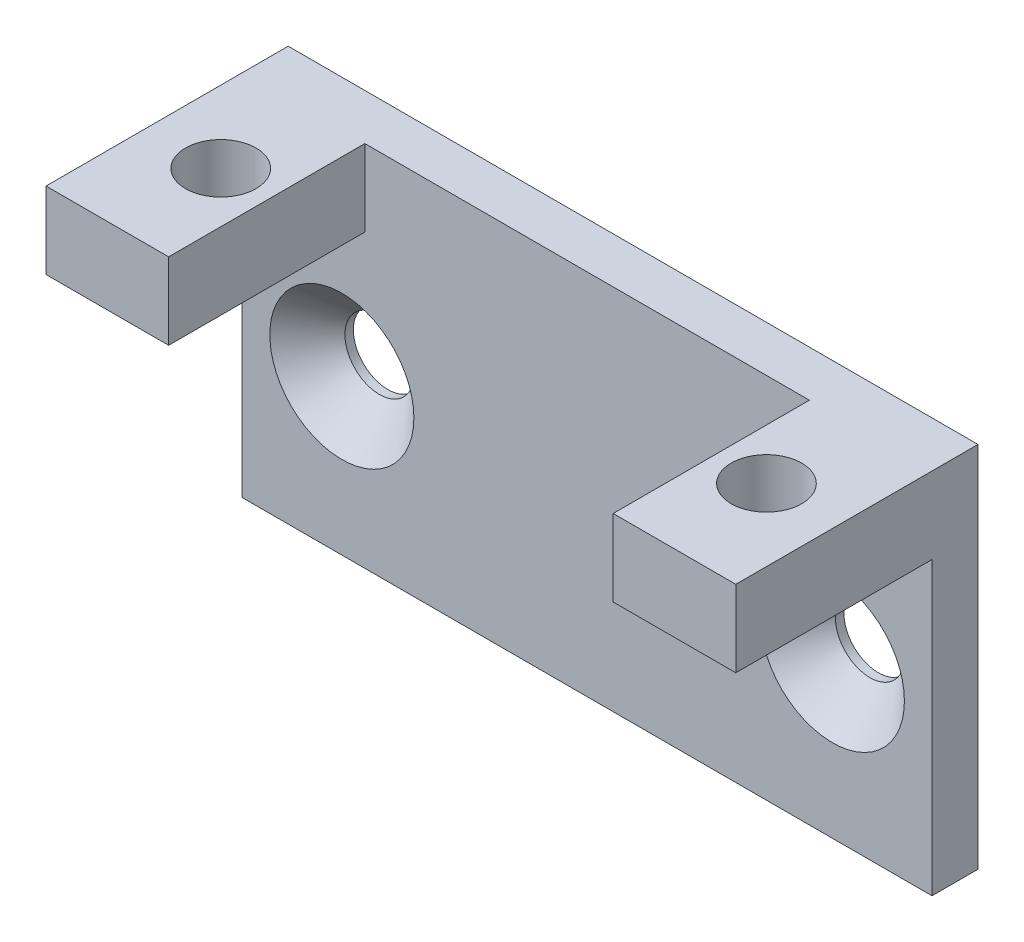
ISO-10303-21;
HEADER;
FILE_DESCRIPTION(('STEP AP214'),'2;1');
FILE_NAME('part.step','',(''),(''),'','','');
FILE_SCHEMA(('AUTOMOTIVE_DESIGN { 1 0 10303 214 1 1 1 1 }'));
ENDSEC;
DATA;
#1=APPLICATION_CONTEXT('core data for automotive mechanical design processes');
#2=APPLICATION_PROTOCOL_DEFINITION('international standard','automotive_design',2000,#1);
#3=PRODUCT_CONTEXT('',#1,'mechanical');
#4=PRODUCT('Part','Part','',(#3));
#5=PRODUCT_RELATED_PRODUCT_CATEGORY('part','',(#4));
#6=PRODUCT_DEFINITION_FORMATION('','',#4);
#7=PRODUCT_DEFINITION_CONTEXT('part definition',#1,'design');
#8=PRODUCT_DEFINITION('design','',#6,#7);
#9=PRODUCT_DEFINITION_SHAPE('','',#8);
#10=(LENGTH_UNIT() NAMED_UNIT(*) SI_UNIT(.MILLI.,.METRE.));
#11=(NAMED_UNIT(*) PLANE_ANGLE_UNIT() SI_UNIT($,.RADIAN.));
#12=(NAMED_UNIT(*) SI_UNIT($,.STERADIAN.) SOLID_ANGLE_UNIT());
#13=UNCERTAINTY_MEASURE_WITH_UNIT(LENGTH_MEASURE(1.E-05),#10,'distance_accuracy_value','');
#14=(GEOMETRIC_REPRESENTATION_CONTEXT(3) GLOBAL_UNCERTAINTY_ASSIGNED_CONTEXT((#13)) GLOBAL_UNIT_ASSIGNED_CONTEXT((#10,
#11,#12)) REPRESENTATION_CONTEXT('',''));
#15=CARTESIAN_POINT('',(0.,0.,0.));
#16=DIRECTION('',(0.,0.,1.));
#17=DIRECTION('',(1.,0.,0.));
#18=AXIS2_PLACEMENT_3D('',#15,#16,#17);
#19=CARTESIAN_POINT('',(0.,19.,0.));
#20=DIRECTION('',(0.,1.,0.));
#21=DIRECTION('',(0.,0.,1.));
#22=AXIS2_PLACEMENT_3D('',#19,#20,#21);
#23=PLANE('',#22);
#24=DIRECTION('',(-1.,0.,0.));
#25=VECTOR('',#24,1.);
#26=CARTESIAN_POINT('',(0.,19.,3.));
#27=LINE('',#26,#25);
#28=CARTESIAN_POINT('',(8.,19.,3.));
#29=VERTEX_POINT('',#28);
#30=CARTESIAN_POINT('',(0.,19.,3.));
#31=VERTEX_POINT('',#30);
#32=EDGE_CURVE('E36',#29,#31,#27,.T.);
#33=ORIENTED_EDGE('',*,*,#32,.F.);
#34=DIRECTION('',(0.,0.,-1.));
#35=VECTOR('',#34,1.);
#36=CARTESIAN_POINT('',(8.,19.,15.8));
#37=LINE('',#36,#35);
#38=CARTESIAN_POINT('',(8.,19.,15.8));
#39=VERTEX_POINT('',#38);
#40=EDGE_CURVE('E191',#39,#29,#37,.T.);
#41=ORIENTED_EDGE('',*,*,#40,.F.);
#42=DIRECTION('',(1.,0.,0.));
#43=VECTOR('',#42,1.);
#44=CARTESIAN_POINT('',(0.,19.,15.8));
#45=LINE('',#44,#43);
#46=CARTESIAN_POINT('',(0.,19.,15.8));
#47=VERTEX_POINT('',#46);
#48=EDGE_CURVE('E141',#47,#39,#45,.T.);
#49=ORIENTED_EDGE('',*,*,#48,.F.);
#50=DIRECTION('',(0.,0.,1.));
#51=VECTOR('',#50,1.);
#52=CARTESIAN_POINT('',(0.,19.,0.));
#53=LINE('',#52,#51);
#54=EDGE_CURVE('E143',#31,#47,#53,.T.);
#55=ORIENTED_EDGE('',*,*,#54,.F.);
#56=EDGE_LOOP('',(#33,#41,#49,#55));
#57=FACE_BOUND('',#56,.T.);
#58=CARTESIAN_POINT('',(4.7,19.,9.1));
#59=DIRECTION('',(0.,1.,0.));
#60=DIRECTION('',(0.,0.,1.));
#61=AXIS2_PLACEMENT_3D('',#58,#59,#60);
#62=CIRCLE('',#61,2.30000000000001);
#63=CARTESIAN_POINT('',(4.7,19.,11.4));
#64=VERTEX_POINT('',#63);
#65=EDGE_CURVE('E205',#64,#64,#62,.F.);
#66=ORIENTED_EDGE('',*,*,#65,.F.);
#67=EDGE_LOOP('',(#66));
#68=FACE_BOUND('',#67,.T.);
#69=ADVANCED_FACE('F32',(#57,#68),#23,.F.);
#70=CARTESIAN_POINT('',(0.,24.,0.));
#71=DIRECTION('',(0.,-1.,0.));
#72=DIRECTION('',(0.,0.,-1.));
#73=AXIS2_PLACEMENT_3D('',#70,#71,#72);
#74=PLANE('',#73);
#75=DIRECTION('',(1.,0.,0.));
#76=VECTOR('',#75,1.);
#77=CARTESIAN_POINT('',(0.,24.,15.8));
#78=LINE('',#77,#76);
#79=CARTESIAN_POINT('',(0.,24.,15.8));
#80=VERTEX_POINT('',#79);
#81=CARTESIAN_POINT('',(8.,24.,15.8));
#82=VERTEX_POINT('',#81);
#83=EDGE_CURVE('E154',#80,#82,#78,.T.);
#84=ORIENTED_EDGE('',*,*,#83,.T.);
#85=DIRECTION('',(0.,0.,-1.));
#86=VECTOR('',#85,1.);
#87=CARTESIAN_POINT('',(8.,24.,15.8));
#88=LINE('',#87,#86);
#89=CARTESIAN_POINT('',(8.,24.,3.));
#90=VERTEX_POINT('',#89);
#91=EDGE_CURVE('E197',#82,#90,#88,.T.);
#92=ORIENTED_EDGE('',*,*,#91,.T.);
#93=DIRECTION('',(1.,0.,0.));
#94=VECTOR('',#93,1.);
#95=CARTESIAN_POINT('',(8.,24.,3.));
#96=LINE('',#95,#94);
#97=CARTESIAN_POINT('',(37.,24.,3.));
#98=VERTEX_POINT('',#97);
#99=EDGE_CURVE('E195',#90,#98,#96,.T.);
#100=ORIENTED_EDGE('',*,*,#99,.T.);
#101=DIRECTION('',(0.,0.,1.));
#102=VECTOR('',#101,1.);
#103=CARTESIAN_POINT('',(37.,24.,15.8));
#104=LINE('',#103,#102);
#105=CARTESIAN_POINT('',(37.,24.,15.8));
#106=VERTEX_POINT('',#105);
#107=EDGE_CURVE('E171',#98,#106,#104,.T.);
#108=ORIENTED_EDGE('',*,*,#107,.T.);
#109=CARTESIAN_POINT('',(45.,24.,15.8));
#110=VERTEX_POINT('',#109);
#111=EDGE_CURVE('E153',#106,#110,#78,.T.);
#112=ORIENTED_EDGE('',*,*,#111,.T.);
#113=DIRECTION('',(0.,0.,-1.));
#114=VECTOR('',#113,1.);
#115=CARTESIAN_POINT('',(45.,24.,0.));
#116=LINE('',#115,#114);
#117=CARTESIAN_POINT('',(45.,24.,0.));
#118=VERTEX_POINT('',#117);
#119=EDGE_CURVE('E133',#110,#118,#116,.T.);
#120=ORIENTED_EDGE('',*,*,#119,.T.);
#121=DIRECTION('',(1.,0.,0.));
#122=VECTOR('',#121,1.);
#123=CARTESIAN_POINT('',(0.,24.,0.));
#124=LINE('',#123,#122);
#125=CARTESIAN_POINT('',(0.,24.,0.));
#126=VERTEX_POINT('',#125);
#127=EDGE_CURVE('E152',#126,#118,#124,.T.);
#128=ORIENTED_EDGE('',*,*,#127,.F.);
#129=DIRECTION('',(0.,0.,-1.));
#130=VECTOR('',#129,1.);
#131=CARTESIAN_POINT('',(0.,24.,0.));
#132=LINE('',#131,#130);
#133=EDGE_CURVE('E102',#80,#126,#132,.T.);
#134=ORIENTED_EDGE('',*,*,#133,.F.);
#135=EDGE_LOOP('',(#84,#92,#100,#108,#112,#120,#128,#134));
#136=FACE_BOUND('',#135,.T.);
#137=CARTESIAN_POINT('',(40.3,24.,9.1));
#138=DIRECTION('',(0.,1.,0.));
#139=DIRECTION('',(0.,0.,1.));
#140=AXIS2_PLACEMENT_3D('',#137,#138,#139);
#141=CIRCLE('',#140,2.30000000000001);
#142=CARTESIAN_POINT('',(40.3,24.,11.4));
#143=VERTEX_POINT('',#142);
#144=EDGE_CURVE('E202',#143,#143,#141,.T.);
#145=ORIENTED_EDGE('',*,*,#144,.F.);
#146=EDGE_LOOP('',(#145));
#147=FACE_BOUND('',#146,.T.);
#148=CARTESIAN_POINT('',(4.7,24.,9.1));
#149=DIRECTION('',(0.,-1.,0.));
#150=DIRECTION('',(0.,0.,1.));
#151=AXIS2_PLACEMENT_3D('',#148,#149,#150);
#152=CIRCLE('',#151,2.30000000000001);
#153=CARTESIAN_POINT('',(4.7,24.,11.4));
#154=VERTEX_POINT('',#153);
#155=EDGE_CURVE('E208',#154,#154,#152,.T.);
#156=ORIENTED_EDGE('',*,*,#155,.T.);
#157=EDGE_LOOP('',(#156));
#158=FACE_BOUND('',#157,.T.);
#159=ADVANCED_FACE('F166',(#136,#147,#158),#74,.F.);
#160=CARTESIAN_POINT('',(0.,19.,15.8));
#161=DIRECTION('',(0.,0.,-1.));
#162=DIRECTION('',(-1.,0.,0.));
#163=AXIS2_PLACEMENT_3D('',#160,#161,#162);
#164=PLANE('',#163);
#165=DIRECTION('',(0.,-1.,0.));
#166=VECTOR('',#165,1.);
#167=CARTESIAN_POINT('',(8.,22.,15.8));
#168=LINE('',#167,#166);
#169=EDGE_CURVE('E131',#82,#39,#168,.T.);
#170=ORIENTED_EDGE('',*,*,#169,.F.);
#171=ORIENTED_EDGE('',*,*,#83,.F.);
#172=DIRECTION('',(0.,1.,0.));
#173=VECTOR('',#172,1.);
#174=CARTESIAN_POINT('',(0.,19.,15.8));
#175=LINE('',#174,#173);
#176=EDGE_CURVE('E178',#47,#80,#175,.T.);
#177=ORIENTED_EDGE('',*,*,#176,.F.);
#178=ORIENTED_EDGE('',*,*,#48,.T.);
#179=EDGE_LOOP('',(#170,#171,#177,#178));
#180=FACE_BOUND('',#179,.T.);
#181=ADVANCED_FACE('F227',(#180),#164,.F.);
#182=CARTESIAN_POINT('',(0.,0.,3.));
#183=DIRECTION('',(1.,0.,0.));
#184=DIRECTION('',(0.,0.,-1.));
#185=AXIS2_PLACEMENT_3D('',#182,#183,#184);
#186=PLANE('',#185);
#187=DIRECTION('',(0.,-1.,0.));
#188=VECTOR('',#187,1.);
#189=CARTESIAN_POINT('',(0.,0.,0.));
#190=LINE('',#189,#188);
#191=CARTESIAN_POINT('',(0.,0.,0.));
#192=VERTEX_POINT('',#191);
#193=EDGE_CURVE('E99',#126,#192,#190,.T.);
#194=ORIENTED_EDGE('',*,*,#193,.T.);
#195=DIRECTION('',(0.,0.,-1.));
#196=VECTOR('',#195,1.);
#197=CARTESIAN_POINT('',(0.,0.,3.));
#198=LINE('',#197,#196);
#199=CARTESIAN_POINT('',(0.,0.,3.));
#200=VERTEX_POINT('',#199);
#201=EDGE_CURVE('E11',#200,#192,#198,.T.);
#202=ORIENTED_EDGE('',*,*,#201,.F.);
#203=DIRECTION('',(0.,-1.,0.));
#204=VECTOR('',#203,1.);
#205=CARTESIAN_POINT('',(0.,0.,3.));
#206=LINE('',#205,#204);
#207=EDGE_CURVE('E90',#31,#200,#206,.T.);
#208=ORIENTED_EDGE('',*,*,#207,.F.);
#209=ORIENTED_EDGE('',*,*,#54,.T.);
#210=ORIENTED_EDGE('',*,*,#176,.T.);
#211=ORIENTED_EDGE('',*,*,#133,.T.);
#212=EDGE_LOOP('',(#194,#202,#208,#209,#210,#211));
#213=FACE_BOUND('',#212,.T.);
#214=ADVANCED_FACE('F34',(#213),#186,.F.);
#215=CARTESIAN_POINT('',(0.,0.,3.));
#216=DIRECTION('',(0.,1.,0.));
#217=DIRECTION('',(0.,0.,1.));
#218=AXIS2_PLACEMENT_3D('',#215,#216,#217);
#219=PLANE('',#218);
#220=DIRECTION('',(1.,0.,0.));
#221=VECTOR('',#220,1.);
#222=CARTESIAN_POINT('',(0.,0.,0.));
#223=LINE('',#222,#221);
#224=CARTESIAN_POINT('',(45.,0.,0.));
#225=VERTEX_POINT('',#224);
#226=EDGE_CURVE('E64',#192,#225,#223,.T.);
#227=ORIENTED_EDGE('',*,*,#226,.T.);
#228=DIRECTION('',(0.,0.,-1.));
#229=VECTOR('',#228,1.);
#230=CARTESIAN_POINT('',(45.,0.,3.));
#231=LINE('',#230,#229);
#232=CARTESIAN_POINT('',(45.,0.,3.));
#233=VERTEX_POINT('',#232);
#234=EDGE_CURVE('E43',#233,#225,#231,.T.);
#235=ORIENTED_EDGE('',*,*,#234,.F.);
#236=DIRECTION('',(1.,0.,0.));
#237=VECTOR('',#236,1.);
#238=CARTESIAN_POINT('',(0.,0.,3.));
#239=LINE('',#238,#237);
#240=EDGE_CURVE('E82',#200,#233,#239,.T.);
#241=ORIENTED_EDGE('',*,*,#240,.F.);
#242=ORIENTED_EDGE('',*,*,#201,.T.);
#243=EDGE_LOOP('',(#227,#235,#241,#242));
#244=FACE_BOUND('',#243,.T.);
#245=ADVANCED_FACE('F83',(#244),#219,.F.);
#246=CARTESIAN_POINT('',(45.,0.,3.));
#247=DIRECTION('',(-1.,0.,0.));
#248=DIRECTION('',(0.,0.,1.));
#249=AXIS2_PLACEMENT_3D('',#246,#247,#248);
#250=PLANE('',#249);
#251=DIRECTION('',(0.,1.,0.));
#252=VECTOR('',#251,1.);
#253=CARTESIAN_POINT('',(45.,0.,0.));
#254=LINE('',#253,#252);
#255=EDGE_CURVE('E96',#225,#118,#254,.T.);
#256=ORIENTED_EDGE('',*,*,#255,.T.);
#257=ORIENTED_EDGE('',*,*,#119,.F.);
#258=DIRECTION('',(0.,1.,0.));
#259=VECTOR('',#258,1.);
#260=CARTESIAN_POINT('',(45.,19.,15.8));
#261=LINE('',#260,#259);
#262=CARTESIAN_POINT('',(45.,19.,15.8));
#263=VERTEX_POINT('',#262);
#264=EDGE_CURVE('E129',#263,#110,#261,.T.);
#265=ORIENTED_EDGE('',*,*,#264,.F.);
#266=DIRECTION('',(0.,0.,1.));
#267=VECTOR('',#266,1.);
#268=CARTESIAN_POINT('',(45.,19.,0.));
#269=LINE('',#268,#267);
#270=CARTESIAN_POINT('',(45.,19.,3.));
#271=VERTEX_POINT('',#270);
#272=EDGE_CURVE('E125',#271,#263,#269,.T.);
#273=ORIENTED_EDGE('',*,*,#272,.F.);
#274=DIRECTION('',(0.,1.,0.));
#275=VECTOR('',#274,1.);
#276=CARTESIAN_POINT('',(45.,0.,3.));
#277=LINE('',#276,#275);
#278=EDGE_CURVE('E89',#233,#271,#277,.T.);
#279=ORIENTED_EDGE('',*,*,#278,.F.);
#280=ORIENTED_EDGE('',*,*,#234,.T.);
#281=EDGE_LOOP('',(#256,#257,#265,#273,#279,#280));
#282=FACE_BOUND('',#281,.T.);
#283=ADVANCED_FACE('F123',(#282),#250,.F.);
#284=CARTESIAN_POINT('',(0.,0.,3.));
#285=DIRECTION('',(0.,0.,-1.));
#286=DIRECTION('',(-1.,0.,0.));
#287=AXIS2_PLACEMENT_3D('',#284,#285,#286);
#288=PLANE('',#287);
#289=CARTESIAN_POINT('',(6.5,10.1,3.));
#290=DIRECTION('',(0.,0.,1.));
#291=DIRECTION('',(1.,0.,0.));
#292=AXIS2_PLACEMENT_3D('',#289,#290,#291);
#293=CIRCLE('',#292,4.7);
#294=CARTESIAN_POINT('',(11.2,10.1,3.));
#295=VERTEX_POINT('',#294);
#296=EDGE_CURVE('E258',#295,#295,#293,.T.);
#297=ORIENTED_EDGE('',*,*,#296,.F.);
#298=EDGE_LOOP('',(#297));
#299=FACE_BOUND('',#298,.T.);
#300=CARTESIAN_POINT('',(38.5,10.1,3.));
#301=DIRECTION('',(0.,0.,1.));
#302=DIRECTION('',(1.,0.,0.));
#303=AXIS2_PLACEMENT_3D('',#300,#301,#302);
#304=CIRCLE('',#303,4.7);
#305=CARTESIAN_POINT('',(43.2,10.1,3.));
#306=VERTEX_POINT('',#305);
#307=EDGE_CURVE('E428',#306,#306,#304,.T.);
#308=ORIENTED_EDGE('',*,*,#307,.F.);
#309=EDGE_LOOP('',(#308));
#310=FACE_BOUND('',#309,.T.);
#311=CARTESIAN_POINT('',(37.,19.,3.));
#312=VERTEX_POINT('',#311);
#313=EDGE_CURVE('E72',#271,#312,#27,.T.);
#314=ORIENTED_EDGE('',*,*,#313,.T.);
#315=DIRECTION('',(0.,-1.,0.));
#316=VECTOR('',#315,1.);
#317=CARTESIAN_POINT('',(37.,22.,3.));
#318=LINE('',#317,#316);
#319=EDGE_CURVE('E184',#98,#312,#318,.T.);
#320=ORIENTED_EDGE('',*,*,#319,.F.);
#321=ORIENTED_EDGE('',*,*,#99,.F.);
#322=DIRECTION('',(0.,-1.,0.));
#323=VECTOR('',#322,1.);
#324=CARTESIAN_POINT('',(8.,22.,3.));
#325=LINE('',#324,#323);
#326=EDGE_CURVE('E182',#90,#29,#325,.T.);
#327=ORIENTED_EDGE('',*,*,#326,.T.);
#328=ORIENTED_EDGE('',*,*,#32,.T.);
#329=ORIENTED_EDGE('',*,*,#207,.T.);
#330=ORIENTED_EDGE('',*,*,#240,.T.);
#331=ORIENTED_EDGE('',*,*,#278,.T.);
#332=EDGE_LOOP('',(#314,#320,#321,#327,#328,#329,#330,#331));
#333=FACE_BOUND('',#332,.T.);
#334=ADVANCED_FACE('F93',(#299,#310,#333),#288,.F.);
#335=CARTESIAN_POINT('',(0.,0.,0.));
#336=DIRECTION('',(0.,0.,-1.));
#337=DIRECTION('',(-1.,0.,0.));
#338=AXIS2_PLACEMENT_3D('',#335,#336,#337);
#339=PLANE('',#338);
#340=CARTESIAN_POINT('',(6.5,10.1,0.));
#341=DIRECTION('',(0.,0.,1.));
#342=DIRECTION('',(1.,0.,0.));
#343=AXIS2_PLACEMENT_3D('',#340,#341,#342);
#344=CIRCLE('',#343,2.25);
#345=CARTESIAN_POINT('',(8.75,10.1,0.));
#346=VERTEX_POINT('',#345);
#347=EDGE_CURVE('E436',#346,#346,#344,.T.);
#348=ORIENTED_EDGE('',*,*,#347,.T.);
#349=EDGE_LOOP('',(#348));
#350=FACE_BOUND('',#349,.T.);
#351=CARTESIAN_POINT('',(38.5,10.1,0.));
#352=DIRECTION('',(0.,0.,1.));
#353=DIRECTION('',(1.,0.,0.));
#354=AXIS2_PLACEMENT_3D('',#351,#352,#353);
#355=CIRCLE('',#354,2.25);
#356=CARTESIAN_POINT('',(40.75,10.1,0.));
#357=VERTEX_POINT('',#356);
#358=EDGE_CURVE('E105',#357,#357,#355,.T.);
#359=ORIENTED_EDGE('',*,*,#358,.T.);
#360=EDGE_LOOP('',(#359));
#361=FACE_BOUND('',#360,.T.);
#362=ORIENTED_EDGE('',*,*,#193,.F.);
#363=ORIENTED_EDGE('',*,*,#127,.T.);
#364=ORIENTED_EDGE('',*,*,#255,.F.);
#365=ORIENTED_EDGE('',*,*,#226,.F.);
#366=EDGE_LOOP('',(#362,#363,#364,#365));
#367=FACE_BOUND('',#366,.T.);
#368=ADVANCED_FACE('F176',(#350,#361,#367),#339,.T.);
#369=CARTESIAN_POINT('',(38.5,10.1,3.));
#370=DIRECTION('',(0.,0.,1.));
#371=DIRECTION('',(1.,0.,0.));
#372=AXIS2_PLACEMENT_3D('',#369,#370,#371);
#373=CYLINDRICAL_SURFACE('',#372,2.25);
#374=ORIENTED_EDGE('',*,*,#358,.F.);
#375=EDGE_LOOP('',(#374));
#376=FACE_BOUND('',#375,.T.);
#377=CARTESIAN_POINT('',(38.5,10.1,0.549999999999992));
#378=DIRECTION('',(0.,0.,1.));
#379=DIRECTION('',(1.,0.,0.));
#380=AXIS2_PLACEMENT_3D('',#377,#378,#379);
#381=CIRCLE('',#380,2.24999999999999);
#382=CARTESIAN_POINT('',(40.75,10.1,0.549999999999992));
#383=VERTEX_POINT('',#382);
#384=EDGE_CURVE('E109',#383,#383,#381,.T.);
#385=ORIENTED_EDGE('',*,*,#384,.T.);
#386=EDGE_LOOP('',(#385));
#387=FACE_BOUND('',#386,.T.);
#388=ADVANCED_FACE('F315',(#376,#387),#373,.F.);
#389=CARTESIAN_POINT('',(38.5,10.1,3.));
#390=DIRECTION('',(0.,0.,1.));
#391=DIRECTION('',(1.,0.,0.));
#392=AXIS2_PLACEMENT_3D('',#389,#390,#391);
#393=CONICAL_SURFACE('',#392,4.7,0.785398163397449);
#394=ORIENTED_EDGE('',*,*,#384,.F.);
#395=EDGE_LOOP('',(#394));
#396=FACE_BOUND('',#395,.T.);
#397=ORIENTED_EDGE('',*,*,#307,.T.);
#398=EDGE_LOOP('',(#397));
#399=FACE_BOUND('',#398,.T.);
#400=ADVANCED_FACE('F349',(#396,#399),#393,.F.);
#401=CARTESIAN_POINT('',(6.5,10.1,3.));
#402=DIRECTION('',(0.,0.,1.));
#403=DIRECTION('',(1.,0.,0.));
#404=AXIS2_PLACEMENT_3D('',#401,#402,#403);
#405=CYLINDRICAL_SURFACE('',#404,2.25);
#406=ORIENTED_EDGE('',*,*,#347,.F.);
#407=EDGE_LOOP('',(#406));
#408=FACE_BOUND('',#407,.T.);
#409=CARTESIAN_POINT('',(6.5,10.1,0.549999999999992));
#410=DIRECTION('',(0.,0.,1.));
#411=DIRECTION('',(1.,0.,0.));
#412=AXIS2_PLACEMENT_3D('',#409,#410,#411);
#413=CIRCLE('',#412,2.24999999999999);
#414=CARTESIAN_POINT('',(8.74999999999999,10.1,0.549999999999992));
#415=VERTEX_POINT('',#414);
#416=EDGE_CURVE('E431',#415,#415,#413,.T.);
#417=ORIENTED_EDGE('',*,*,#416,.T.);
#418=EDGE_LOOP('',(#417));
#419=FACE_BOUND('',#418,.T.);
#420=ADVANCED_FACE('F239',(#408,#419),#405,.F.);
#421=CARTESIAN_POINT('',(6.5,10.1,3.));
#422=DIRECTION('',(0.,0.,1.));
#423=DIRECTION('',(1.,0.,0.));
#424=AXIS2_PLACEMENT_3D('',#421,#422,#423);
#425=CONICAL_SURFACE('',#424,4.7,0.785398163397449);
#426=ORIENTED_EDGE('',*,*,#416,.F.);
#427=EDGE_LOOP('',(#426));
#428=FACE_BOUND('',#427,.T.);
#429=ORIENTED_EDGE('',*,*,#296,.T.);
#430=EDGE_LOOP('',(#429));
#431=FACE_BOUND('',#430,.T.);
#432=ADVANCED_FACE('F232',(#428,#431),#425,.F.);
#433=CARTESIAN_POINT('',(40.3,19.,9.1));
#434=DIRECTION('',(0.,1.,0.));
#435=DIRECTION('',(0.,0.,1.));
#436=AXIS2_PLACEMENT_3D('',#433,#434,#435);
#437=CIRCLE('',#436,2.30000000000001);
#438=CARTESIAN_POINT('',(40.3,19.,11.4));
#439=VERTEX_POINT('',#438);
#440=EDGE_CURVE('E199',#439,#439,#437,.T.);
#441=ORIENTED_EDGE('',*,*,#440,.T.);
#442=EDGE_LOOP('',(#441));
#443=FACE_BOUND('',#442,.T.);
#444=CARTESIAN_POINT('',(37.,19.,15.8));
#445=VERTEX_POINT('',#444);
#446=EDGE_CURVE('E156',#445,#263,#45,.T.);
#447=ORIENTED_EDGE('',*,*,#446,.F.);
#448=DIRECTION('',(0.,0.,1.));
#449=VECTOR('',#448,1.);
#450=CARTESIAN_POINT('',(37.,19.,15.8));
#451=LINE('',#450,#449);
#452=EDGE_CURVE('E185',#312,#445,#451,.T.);
#453=ORIENTED_EDGE('',*,*,#452,.F.);
#454=ORIENTED_EDGE('',*,*,#313,.F.);
#455=ORIENTED_EDGE('',*,*,#272,.T.);
#456=EDGE_LOOP('',(#447,#453,#454,#455));
#457=FACE_BOUND('',#456,.T.);
#458=ADVANCED_FACE('F223',(#443,#457),#23,.F.);
#459=ORIENTED_EDGE('',*,*,#111,.F.);
#460=DIRECTION('',(0.,-1.,0.));
#461=VECTOR('',#460,1.);
#462=CARTESIAN_POINT('',(37.,22.,15.8));
#463=LINE('',#462,#461);
#464=EDGE_CURVE('E136',#106,#445,#463,.T.);
#465=ORIENTED_EDGE('',*,*,#464,.T.);
#466=ORIENTED_EDGE('',*,*,#446,.T.);
#467=ORIENTED_EDGE('',*,*,#264,.T.);
#468=EDGE_LOOP('',(#459,#465,#466,#467));
#469=FACE_BOUND('',#468,.T.);
#470=ADVANCED_FACE('F174',(#469),#164,.F.);
#471=CARTESIAN_POINT('',(8.,22.,15.8));
#472=DIRECTION('',(-1.,0.,0.));
#473=DIRECTION('',(0.,0.,1.));
#474=AXIS2_PLACEMENT_3D('',#471,#472,#473);
#475=PLANE('',#474);
#476=ORIENTED_EDGE('',*,*,#40,.T.);
#477=ORIENTED_EDGE('',*,*,#326,.F.);
#478=ORIENTED_EDGE('',*,*,#91,.F.);
#479=ORIENTED_EDGE('',*,*,#169,.T.);
#480=EDGE_LOOP('',(#476,#477,#478,#479));
#481=FACE_BOUND('',#480,.T.);
#482=ADVANCED_FACE('F238',(#481),#475,.F.);
#483=CARTESIAN_POINT('',(37.,22.,15.8));
#484=DIRECTION('',(1.,0.,0.));
#485=DIRECTION('',(0.,0.,-1.));
#486=AXIS2_PLACEMENT_3D('',#483,#484,#485);
#487=PLANE('',#486);
#488=ORIENTED_EDGE('',*,*,#452,.T.);
#489=ORIENTED_EDGE('',*,*,#464,.F.);
#490=ORIENTED_EDGE('',*,*,#107,.F.);
#491=ORIENTED_EDGE('',*,*,#319,.T.);
#492=EDGE_LOOP('',(#488,#489,#490,#491));
#493=FACE_BOUND('',#492,.T.);
#494=ADVANCED_FACE('F269',(#493),#487,.F.);
#495=CARTESIAN_POINT('',(40.3,14.,9.1));
#496=DIRECTION('',(0.,1.,0.));
#497=DIRECTION('',(0.,0.,1.));
#498=AXIS2_PLACEMENT_3D('',#495,#496,#497);
#499=CYLINDRICAL_SURFACE('',#498,2.30000000000001);
#500=ORIENTED_EDGE('',*,*,#144,.T.);
#501=EDGE_LOOP('',(#500));
#502=FACE_BOUND('',#501,.T.);
#503=ORIENTED_EDGE('',*,*,#440,.F.);
#504=EDGE_LOOP('',(#503));
#505=FACE_BOUND('',#504,.T.);
#506=ADVANCED_FACE('F216',(#502,#505),#499,.F.);
#507=CARTESIAN_POINT('',(4.7,14.,9.1));
#508=DIRECTION('',(0.,1.,0.));
#509=DIRECTION('',(0.,0.,1.));
#510=AXIS2_PLACEMENT_3D('',#507,#508,#509);
#511=CYLINDRICAL_SURFACE('',#510,2.30000000000001);
#512=ORIENTED_EDGE('',*,*,#155,.F.);
#513=EDGE_LOOP('',(#512));
#514=FACE_BOUND('',#513,.T.);
#515=ORIENTED_EDGE('',*,*,#65,.T.);
#516=EDGE_LOOP('',(#515));
#517=FACE_BOUND('',#516,.T.);
#518=ADVANCED_FACE('F213',(#514,#517),#511,.F.);
#519=CLOSED_SHELL('',(#69,#159,#181,#214,#245,#283,#334,#368,#388,#400,#420,#432,#458,#470,#482,
#494,#506,#518));
#520=MANIFOLD_SOLID_BREP('B2',#519);
#521=ADVANCED_BREP_SHAPE_REPRESENTATION('',(#18,#520),#14);
#522=SHAPE_DEFINITION_REPRESENTATION(#9,#521);
ENDSEC;
END-ISO-10303-21;
